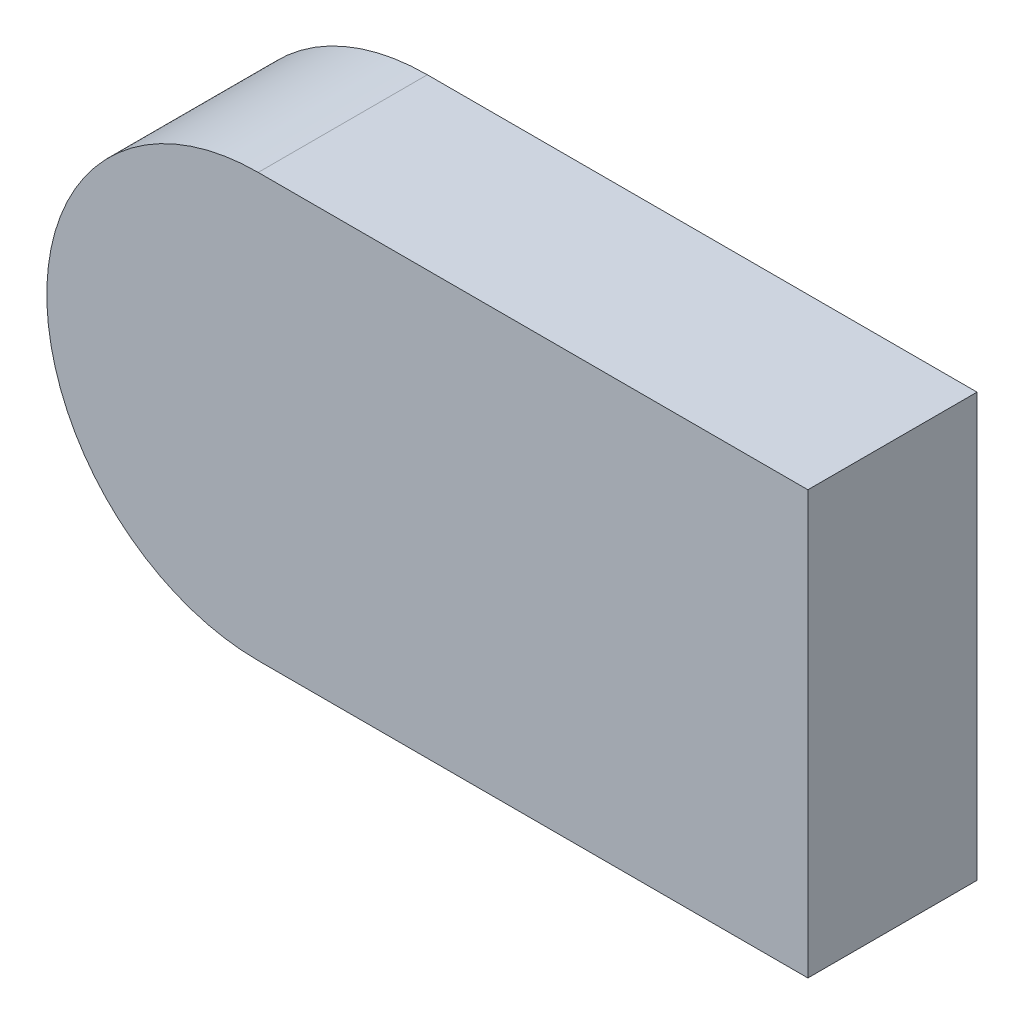
ISO-10303-21;
HEADER;
FILE_DESCRIPTION(('STEP AP214'),'2;1');
FILE_NAME('part.step','',(''),(''),'','','');
FILE_SCHEMA(('AUTOMOTIVE_DESIGN { 1 0 10303 214 1 1 1 1 }'));
ENDSEC;
DATA;
#1=APPLICATION_CONTEXT('core data for automotive mechanical design processes');
#2=APPLICATION_PROTOCOL_DEFINITION('international standard','automotive_design',2000,#1);
#3=PRODUCT_CONTEXT('',#1,'mechanical');
#4=PRODUCT('Part','Part','',(#3));
#5=PRODUCT_RELATED_PRODUCT_CATEGORY('part','',(#4));
#6=PRODUCT_DEFINITION_FORMATION('','',#4);
#7=PRODUCT_DEFINITION_CONTEXT('part definition',#1,'design');
#8=PRODUCT_DEFINITION('design','',#6,#7);
#9=PRODUCT_DEFINITION_SHAPE('','',#8);
#10=(LENGTH_UNIT() NAMED_UNIT(*) SI_UNIT(.MILLI.,.METRE.));
#11=(NAMED_UNIT(*) PLANE_ANGLE_UNIT() SI_UNIT($,.RADIAN.));
#12=(NAMED_UNIT(*) SI_UNIT($,.STERADIAN.) SOLID_ANGLE_UNIT());
#13=UNCERTAINTY_MEASURE_WITH_UNIT(LENGTH_MEASURE(1.E-05),#10,'distance_accuracy_value','');
#14=(GEOMETRIC_REPRESENTATION_CONTEXT(3) GLOBAL_UNCERTAINTY_ASSIGNED_CONTEXT((#13)) GLOBAL_UNIT_ASSIGNED_CONTEXT((#10,
#11,#12)) REPRESENTATION_CONTEXT('',''));
#15=CARTESIAN_POINT('',(0.,0.,0.));
#16=DIRECTION('',(0.,0.,1.));
#17=DIRECTION('',(1.,0.,0.));
#18=AXIS2_PLACEMENT_3D('',#15,#16,#17);
#19=CARTESIAN_POINT('',(2.05,1.125,0.));
#20=DIRECTION('',(0.,-1.,0.));
#21=DIRECTION('',(-1.,0.,0.));
#22=AXIS2_PLACEMENT_3D('',#19,#20,#21);
#23=PLANE('',#22);
#24=DIRECTION('',(0.,0.,1.));
#25=VECTOR('',#24,1.);
#26=CARTESIAN_POINT('',(2.05,1.125,0.));
#27=LINE('',#26,#25);
#28=CARTESIAN_POINT('',(2.05,1.125,0.));
#29=VERTEX_POINT('',#28);
#30=CARTESIAN_POINT('',(2.05,1.125,0.1));
#31=VERTEX_POINT('',#30);
#32=EDGE_CURVE('E11',#29,#31,#27,.T.);
#33=ORIENTED_EDGE('',*,*,#32,.T.);
#34=DIRECTION('',(-1.,0.,0.));
#35=VECTOR('',#34,1.);
#36=CARTESIAN_POINT('',(2.05,1.125,0.1));
#37=LINE('',#36,#35);
#38=CARTESIAN_POINT('',(1.725,1.125,0.1));
#39=VERTEX_POINT('',#38);
#40=EDGE_CURVE('E24',#31,#39,#37,.T.);
#41=ORIENTED_EDGE('',*,*,#40,.T.);
#42=DIRECTION('',(0.,0.,1.));
#43=VECTOR('',#42,1.);
#44=CARTESIAN_POINT('',(1.725,1.125,0.));
#45=LINE('',#44,#43);
#46=CARTESIAN_POINT('',(1.725,1.125,0.));
#47=VERTEX_POINT('',#46);
#48=EDGE_CURVE('E86',#47,#39,#45,.T.);
#49=ORIENTED_EDGE('',*,*,#48,.F.);
#50=DIRECTION('',(-1.,0.,0.));
#51=VECTOR('',#50,1.);
#52=CARTESIAN_POINT('',(2.05,1.125,0.));
#53=LINE('',#52,#51);
#54=EDGE_CURVE('E83',#29,#47,#53,.T.);
#55=ORIENTED_EDGE('',*,*,#54,.F.);
#56=EDGE_LOOP('',(#33,#41,#49,#55));
#57=FACE_BOUND('',#56,.T.);
#58=ADVANCED_FACE('F17',(#57),#23,.T.);
#59=CARTESIAN_POINT('',(1.725,1.25,0.));
#60=DIRECTION('',(0.,0.,-1.));
#61=DIRECTION('',(1.,0.,0.));
#62=AXIS2_PLACEMENT_3D('',#59,#60,#61);
#63=CYLINDRICAL_SURFACE('',#62,0.125);
#64=CARTESIAN_POINT('',(1.725,1.25,0.));
#65=DIRECTION('',(0.,0.,1.));
#66=DIRECTION('',(1.,0.,0.));
#67=AXIS2_PLACEMENT_3D('',#64,#65,#66);
#68=CIRCLE('',#67,0.125);
#69=CARTESIAN_POINT('',(1.725,1.375,0.));
#70=VERTEX_POINT('',#69);
#71=EDGE_CURVE('E80',#70,#47,#68,.T.);
#72=ORIENTED_EDGE('',*,*,#71,.T.);
#73=ORIENTED_EDGE('',*,*,#48,.T.);
#74=CARTESIAN_POINT('',(1.725,1.25,0.1));
#75=DIRECTION('',(0.,0.,1.));
#76=DIRECTION('',(1.,0.,0.));
#77=AXIS2_PLACEMENT_3D('',#74,#75,#76);
#78=CIRCLE('',#77,0.125);
#79=CARTESIAN_POINT('',(1.725,1.375,0.1));
#80=VERTEX_POINT('',#79);
#81=EDGE_CURVE('E78',#80,#39,#78,.T.);
#82=ORIENTED_EDGE('',*,*,#81,.F.);
#83=DIRECTION('',(0.,0.,1.));
#84=VECTOR('',#83,1.);
#85=CARTESIAN_POINT('',(1.725,1.375,0.));
#86=LINE('',#85,#84);
#87=EDGE_CURVE('E67',#70,#80,#86,.T.);
#88=ORIENTED_EDGE('',*,*,#87,.F.);
#89=EDGE_LOOP('',(#72,#73,#82,#88));
#90=FACE_BOUND('',#89,.T.);
#91=ADVANCED_FACE('F89',(#90),#63,.T.);
#92=CARTESIAN_POINT('',(2.05,1.375,0.));
#93=DIRECTION('',(0.,-1.,0.));
#94=DIRECTION('',(-1.,0.,0.));
#95=AXIS2_PLACEMENT_3D('',#92,#93,#94);
#96=PLANE('',#95);
#97=DIRECTION('',(-1.,0.,0.));
#98=VECTOR('',#97,1.);
#99=CARTESIAN_POINT('',(2.05,1.375,0.));
#100=LINE('',#99,#98);
#101=CARTESIAN_POINT('',(2.05,1.375,0.));
#102=VERTEX_POINT('',#101);
#103=EDGE_CURVE('E70',#102,#70,#100,.T.);
#104=ORIENTED_EDGE('',*,*,#103,.T.);
#105=ORIENTED_EDGE('',*,*,#87,.T.);
#106=DIRECTION('',(-1.,0.,0.));
#107=VECTOR('',#106,1.);
#108=CARTESIAN_POINT('',(2.05,1.375,0.1));
#109=LINE('',#108,#107);
#110=CARTESIAN_POINT('',(2.05,1.375,0.1));
#111=VERTEX_POINT('',#110);
#112=EDGE_CURVE('E61',#111,#80,#109,.T.);
#113=ORIENTED_EDGE('',*,*,#112,.F.);
#114=DIRECTION('',(0.,0.,1.));
#115=VECTOR('',#114,1.);
#116=CARTESIAN_POINT('',(2.05,1.375,0.));
#117=LINE('',#116,#115);
#118=EDGE_CURVE('E51',#102,#111,#117,.T.);
#119=ORIENTED_EDGE('',*,*,#118,.F.);
#120=EDGE_LOOP('',(#104,#105,#113,#119));
#121=FACE_BOUND('',#120,.T.);
#122=ADVANCED_FACE('F65',(#121),#96,.F.);
#123=CARTESIAN_POINT('',(2.05,1.125,0.));
#124=DIRECTION('',(-1.,0.,0.));
#125=DIRECTION('',(0.,1.,0.));
#126=AXIS2_PLACEMENT_3D('',#123,#124,#125);
#127=PLANE('',#126);
#128=DIRECTION('',(0.,1.,0.));
#129=VECTOR('',#128,1.);
#130=CARTESIAN_POINT('',(2.05,1.125,0.));
#131=LINE('',#130,#129);
#132=EDGE_CURVE('E57',#29,#102,#131,.T.);
#133=ORIENTED_EDGE('',*,*,#132,.T.);
#134=ORIENTED_EDGE('',*,*,#118,.T.);
#135=DIRECTION('',(0.,1.,0.));
#136=VECTOR('',#135,1.);
#137=CARTESIAN_POINT('',(2.05,1.125,0.1));
#138=LINE('',#137,#136);
#139=EDGE_CURVE('E55',#31,#111,#138,.T.);
#140=ORIENTED_EDGE('',*,*,#139,.F.);
#141=ORIENTED_EDGE('',*,*,#32,.F.);
#142=EDGE_LOOP('',(#133,#134,#140,#141));
#143=FACE_BOUND('',#142,.T.);
#144=ADVANCED_FACE('F53',(#143),#127,.F.);
#145=CARTESIAN_POINT('',(1.850342514613,1.25,0.));
#146=DIRECTION('',(0.,0.,-1.));
#147=DIRECTION('',(-1.,0.,0.));
#148=AXIS2_PLACEMENT_3D('',#145,#146,#147);
#149=PLANE('',#148);
#150=ORIENTED_EDGE('',*,*,#54,.T.);
#151=ORIENTED_EDGE('',*,*,#71,.F.);
#152=ORIENTED_EDGE('',*,*,#103,.F.);
#153=ORIENTED_EDGE('',*,*,#132,.F.);
#154=EDGE_LOOP('',(#150,#151,#152,#153));
#155=FACE_BOUND('',#154,.T.);
#156=ADVANCED_FACE('F91',(#155),#149,.T.);
#157=CARTESIAN_POINT('',(1.850342514613,1.25,0.1));
#158=DIRECTION('',(0.,0.,-1.));
#159=DIRECTION('',(-1.,0.,0.));
#160=AXIS2_PLACEMENT_3D('',#157,#158,#159);
#161=PLANE('',#160);
#162=ORIENTED_EDGE('',*,*,#139,.T.);
#163=ORIENTED_EDGE('',*,*,#112,.T.);
#164=ORIENTED_EDGE('',*,*,#81,.T.);
#165=ORIENTED_EDGE('',*,*,#40,.F.);
#166=EDGE_LOOP('',(#162,#163,#164,#165));
#167=FACE_BOUND('',#166,.T.);
#168=ADVANCED_FACE('F72',(#167),#161,.F.);
#169=CLOSED_SHELL('',(#58,#91,#122,#144,#156,#168));
#170=MANIFOLD_SOLID_BREP('B1',#169);
#171=ADVANCED_BREP_SHAPE_REPRESENTATION('',(#18,#170),#14);
#172=SHAPE_DEFINITION_REPRESENTATION(#9,#171);
ENDSEC;
END-ISO-10303-21;
